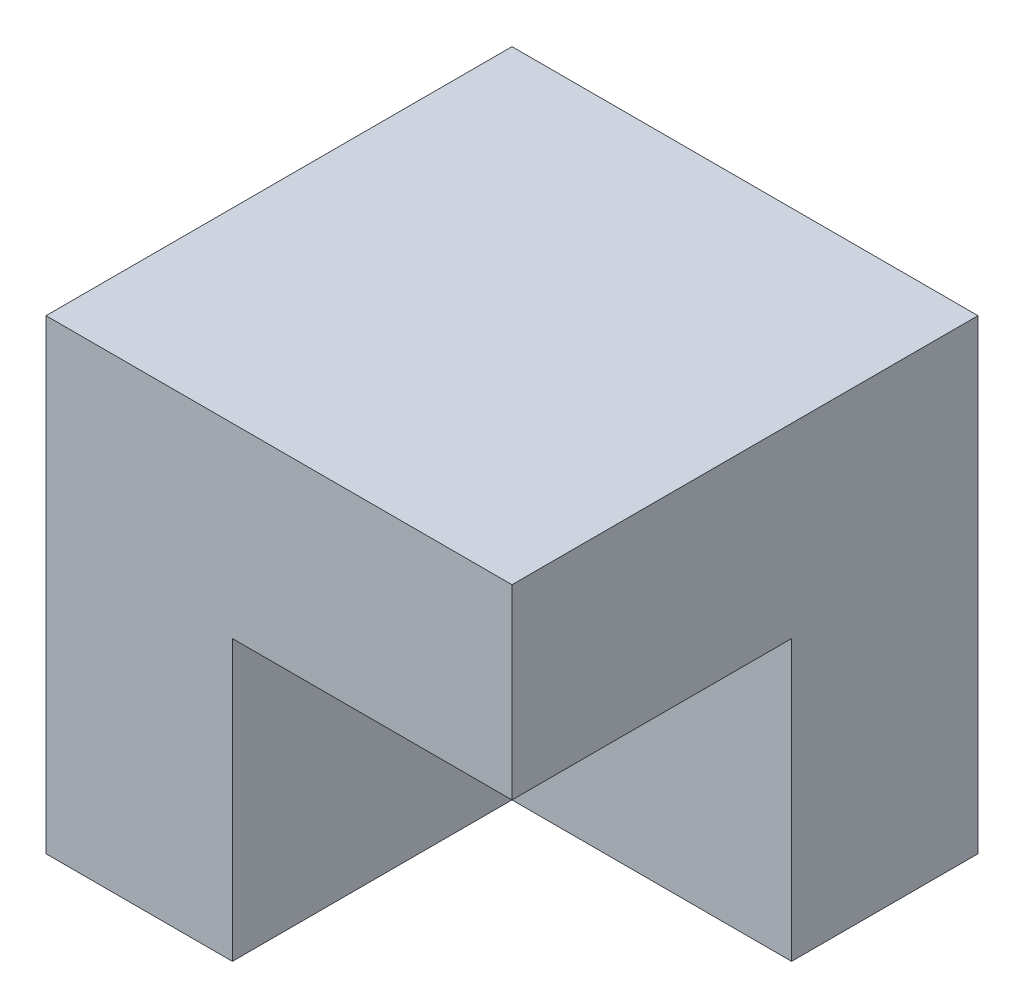
ISO-10303-21;
HEADER;
FILE_DESCRIPTION(('STEP AP214'),'2;1');
FILE_NAME('part.step','',(''),(''),'','','');
FILE_SCHEMA(('AUTOMOTIVE_DESIGN { 1 0 10303 214 1 1 1 1 }'));
ENDSEC;
DATA;
#1=APPLICATION_CONTEXT('core data for automotive mechanical design processes');
#2=APPLICATION_PROTOCOL_DEFINITION('international standard','automotive_design',2000,#1);
#3=PRODUCT_CONTEXT('',#1,'mechanical');
#4=PRODUCT('Part','Part','',(#3));
#5=PRODUCT_RELATED_PRODUCT_CATEGORY('part','',(#4));
#6=PRODUCT_DEFINITION_FORMATION('','',#4);
#7=PRODUCT_DEFINITION_CONTEXT('part definition',#1,'design');
#8=PRODUCT_DEFINITION('design','',#6,#7);
#9=PRODUCT_DEFINITION_SHAPE('','',#8);
#10=(LENGTH_UNIT() NAMED_UNIT(*) SI_UNIT(.MILLI.,.METRE.));
#11=(NAMED_UNIT(*) PLANE_ANGLE_UNIT() SI_UNIT($,.RADIAN.));
#12=(NAMED_UNIT(*) SI_UNIT($,.STERADIAN.) SOLID_ANGLE_UNIT());
#13=UNCERTAINTY_MEASURE_WITH_UNIT(LENGTH_MEASURE(1.E-05),#10,'distance_accuracy_value','');
#14=(GEOMETRIC_REPRESENTATION_CONTEXT(3) GLOBAL_UNCERTAINTY_ASSIGNED_CONTEXT((#13)) GLOBAL_UNIT_ASSIGNED_CONTEXT((#10,
#11,#12)) REPRESENTATION_CONTEXT('',''));
#15=CARTESIAN_POINT('',(0.,0.,0.));
#16=DIRECTION('',(0.,0.,1.));
#17=DIRECTION('',(1.,0.,0.));
#18=AXIS2_PLACEMENT_3D('',#15,#16,#17);
#19=CARTESIAN_POINT('',(-2.5,5.,2.5));
#20=DIRECTION('',(0.,0.,-1.));
#21=DIRECTION('',(-1.,0.,0.));
#22=AXIS2_PLACEMENT_3D('',#19,#20,#21);
#23=PLANE('',#22);
#24=DIRECTION('',(0.,-1.,0.));
#25=VECTOR('',#24,1.);
#26=CARTESIAN_POINT('',(-0.500000000000001,3.,2.5));
#27=LINE('',#26,#25);
#28=CARTESIAN_POINT('',(-0.500000000000001,3.,2.5));
#29=VERTEX_POINT('',#28);
#30=CARTESIAN_POINT('',(-0.500000000000001,0.,2.5));
#31=VERTEX_POINT('',#30);
#32=EDGE_CURVE('E61',#29,#31,#27,.T.);
#33=ORIENTED_EDGE('',*,*,#32,.F.);
#34=DIRECTION('',(1.,0.,0.));
#35=VECTOR('',#34,1.);
#36=CARTESIAN_POINT('',(2.5,3.,2.5));
#37=LINE('',#36,#35);
#38=CARTESIAN_POINT('',(2.5,3.,2.5));
#39=VERTEX_POINT('',#38);
#40=EDGE_CURVE('E148',#29,#39,#37,.T.);
#41=ORIENTED_EDGE('',*,*,#40,.T.);
#42=DIRECTION('',(0.,-1.,0.));
#43=VECTOR('',#42,1.);
#44=CARTESIAN_POINT('',(2.5,5.,2.5));
#45=LINE('',#44,#43);
#46=CARTESIAN_POINT('',(2.5,5.,2.5));
#47=VERTEX_POINT('',#46);
#48=EDGE_CURVE('E54',#47,#39,#45,.T.);
#49=ORIENTED_EDGE('',*,*,#48,.F.);
#50=DIRECTION('',(1.,0.,0.));
#51=VECTOR('',#50,1.);
#52=CARTESIAN_POINT('',(-2.5,5.,2.5));
#53=LINE('',#52,#51);
#54=CARTESIAN_POINT('',(-2.5,5.,2.5));
#55=VERTEX_POINT('',#54);
#56=EDGE_CURVE('E95',#55,#47,#53,.T.);
#57=ORIENTED_EDGE('',*,*,#56,.F.);
#58=DIRECTION('',(0.,-1.,0.));
#59=VECTOR('',#58,1.);
#60=CARTESIAN_POINT('',(-2.5,5.,2.5));
#61=LINE('',#60,#59);
#62=CARTESIAN_POINT('',(-2.5,0.,2.5));
#63=VERTEX_POINT('',#62);
#64=EDGE_CURVE('E11',#55,#63,#61,.T.);
#65=ORIENTED_EDGE('',*,*,#64,.T.);
#66=DIRECTION('',(1.,0.,0.));
#67=VECTOR('',#66,1.);
#68=CARTESIAN_POINT('',(-2.5,0.,2.5));
#69=LINE('',#68,#67);
#70=EDGE_CURVE('E171',#63,#31,#69,.T.);
#71=ORIENTED_EDGE('',*,*,#70,.T.);
#72=EDGE_LOOP('',(#33,#41,#49,#57,#65,#71));
#73=FACE_BOUND('',#72,.T.);
#74=ADVANCED_FACE('F45',(#73),#23,.F.);
#75=CARTESIAN_POINT('',(2.5,5.,-2.5));
#76=DIRECTION('',(-1.,0.,0.));
#77=DIRECTION('',(0.,0.,1.));
#78=AXIS2_PLACEMENT_3D('',#75,#76,#77);
#79=PLANE('',#78);
#80=DIRECTION('',(0.,-1.,0.));
#81=VECTOR('',#80,1.);
#82=CARTESIAN_POINT('',(2.5,3.,-0.5));
#83=LINE('',#82,#81);
#84=CARTESIAN_POINT('',(2.5,3.,-0.5));
#85=VERTEX_POINT('',#84);
#86=CARTESIAN_POINT('',(2.5,0.,-0.5));
#87=VERTEX_POINT('',#86);
#88=EDGE_CURVE('E127',#85,#87,#83,.T.);
#89=ORIENTED_EDGE('',*,*,#88,.T.);
#90=DIRECTION('',(0.,0.,-1.));
#91=VECTOR('',#90,1.);
#92=CARTESIAN_POINT('',(2.5,0.,-2.5));
#93=LINE('',#92,#91);
#94=CARTESIAN_POINT('',(2.5,0.,-2.5));
#95=VERTEX_POINT('',#94);
#96=EDGE_CURVE('E175',#87,#95,#93,.T.);
#97=ORIENTED_EDGE('',*,*,#96,.T.);
#98=DIRECTION('',(0.,-1.,0.));
#99=VECTOR('',#98,1.);
#100=CARTESIAN_POINT('',(2.5,5.,-2.5));
#101=LINE('',#100,#99);
#102=CARTESIAN_POINT('',(2.5,5.,-2.5));
#103=VERTEX_POINT('',#102);
#104=EDGE_CURVE('E182',#103,#95,#101,.T.);
#105=ORIENTED_EDGE('',*,*,#104,.F.);
#106=DIRECTION('',(0.,0.,-1.));
#107=VECTOR('',#106,1.);
#108=CARTESIAN_POINT('',(2.5,5.,-2.5));
#109=LINE('',#108,#107);
#110=EDGE_CURVE('E162',#47,#103,#109,.T.);
#111=ORIENTED_EDGE('',*,*,#110,.F.);
#112=ORIENTED_EDGE('',*,*,#48,.T.);
#113=DIRECTION('',(0.,0.,-1.));
#114=VECTOR('',#113,1.);
#115=CARTESIAN_POINT('',(2.5,3.,2.5));
#116=LINE('',#115,#114);
#117=EDGE_CURVE('E119',#39,#85,#116,.T.);
#118=ORIENTED_EDGE('',*,*,#117,.T.);
#119=EDGE_LOOP('',(#89,#97,#105,#111,#112,#118));
#120=FACE_BOUND('',#119,.T.);
#121=ADVANCED_FACE('F138',(#120),#79,.F.);
#122=CARTESIAN_POINT('',(0.,0.,0.));
#123=DIRECTION('',(0.,1.,0.));
#124=DIRECTION('',(0.,0.,1.));
#125=AXIS2_PLACEMENT_3D('',#122,#123,#124);
#126=PLANE('',#125);
#127=DIRECTION('',(-1.,0.,0.));
#128=VECTOR('',#127,1.);
#129=CARTESIAN_POINT('',(2.5,0.,-0.5));
#130=LINE('',#129,#128);
#131=CARTESIAN_POINT('',(-0.5,0.,-0.5));
#132=VERTEX_POINT('',#131);
#133=EDGE_CURVE('E130',#87,#132,#130,.T.);
#134=ORIENTED_EDGE('',*,*,#133,.T.);
#135=DIRECTION('',(0.,0.,1.));
#136=VECTOR('',#135,1.);
#137=CARTESIAN_POINT('',(-0.500000000000001,0.,2.5));
#138=LINE('',#137,#136);
#139=EDGE_CURVE('E141',#132,#31,#138,.T.);
#140=ORIENTED_EDGE('',*,*,#139,.T.);
#141=ORIENTED_EDGE('',*,*,#70,.F.);
#142=DIRECTION('',(0.,0.,1.));
#143=VECTOR('',#142,1.);
#144=CARTESIAN_POINT('',(-2.5,0.,-2.5));
#145=LINE('',#144,#143);
#146=CARTESIAN_POINT('',(-2.5,0.,-2.5));
#147=VERTEX_POINT('',#146);
#148=EDGE_CURVE('E134',#147,#63,#145,.T.);
#149=ORIENTED_EDGE('',*,*,#148,.F.);
#150=DIRECTION('',(-1.,0.,0.));
#151=VECTOR('',#150,1.);
#152=CARTESIAN_POINT('',(-2.5,0.,-2.5));
#153=LINE('',#152,#151);
#154=EDGE_CURVE('E88',#95,#147,#153,.T.);
#155=ORIENTED_EDGE('',*,*,#154,.F.);
#156=ORIENTED_EDGE('',*,*,#96,.F.);
#157=EDGE_LOOP('',(#134,#140,#141,#149,#155,#156));
#158=FACE_BOUND('',#157,.T.);
#159=ADVANCED_FACE('F189',(#158),#126,.F.);
#160=CARTESIAN_POINT('',(-2.5,5.,-2.5));
#161=DIRECTION('',(1.,0.,0.));
#162=DIRECTION('',(0.,0.,-1.));
#163=AXIS2_PLACEMENT_3D('',#160,#161,#162);
#164=PLANE('',#163);
#165=ORIENTED_EDGE('',*,*,#148,.T.);
#166=ORIENTED_EDGE('',*,*,#64,.F.);
#167=DIRECTION('',(0.,0.,1.));
#168=VECTOR('',#167,1.);
#169=CARTESIAN_POINT('',(-2.5,5.,-2.5));
#170=LINE('',#169,#168);
#171=CARTESIAN_POINT('',(-2.5,5.,-2.5));
#172=VERTEX_POINT('',#171);
#173=EDGE_CURVE('E157',#172,#55,#170,.T.);
#174=ORIENTED_EDGE('',*,*,#173,.F.);
#175=DIRECTION('',(0.,-1.,0.));
#176=VECTOR('',#175,1.);
#177=CARTESIAN_POINT('',(-2.5,5.,-2.5));
#178=LINE('',#177,#176);
#179=EDGE_CURVE('E167',#172,#147,#178,.T.);
#180=ORIENTED_EDGE('',*,*,#179,.T.);
#181=EDGE_LOOP('',(#165,#166,#174,#180));
#182=FACE_BOUND('',#181,.T.);
#183=ADVANCED_FACE('F47',(#182),#164,.F.);
#184=CARTESIAN_POINT('',(-2.5,5.,-2.5));
#185=DIRECTION('',(0.,0.,1.));
#186=DIRECTION('',(1.,0.,0.));
#187=AXIS2_PLACEMENT_3D('',#184,#185,#186);
#188=PLANE('',#187);
#189=ORIENTED_EDGE('',*,*,#154,.T.);
#190=ORIENTED_EDGE('',*,*,#179,.F.);
#191=DIRECTION('',(-1.,0.,0.));
#192=VECTOR('',#191,1.);
#193=CARTESIAN_POINT('',(-2.5,5.,-2.5));
#194=LINE('',#193,#192);
#195=EDGE_CURVE('E70',#103,#172,#194,.T.);
#196=ORIENTED_EDGE('',*,*,#195,.F.);
#197=ORIENTED_EDGE('',*,*,#104,.T.);
#198=EDGE_LOOP('',(#189,#190,#196,#197));
#199=FACE_BOUND('',#198,.T.);
#200=ADVANCED_FACE('F186',(#199),#188,.F.);
#201=CARTESIAN_POINT('',(0.,5.,0.));
#202=DIRECTION('',(0.,1.,0.));
#203=DIRECTION('',(0.,0.,1.));
#204=AXIS2_PLACEMENT_3D('',#201,#202,#203);
#205=PLANE('',#204);
#206=ORIENTED_EDGE('',*,*,#173,.T.);
#207=ORIENTED_EDGE('',*,*,#56,.T.);
#208=ORIENTED_EDGE('',*,*,#110,.T.);
#209=ORIENTED_EDGE('',*,*,#195,.T.);
#210=EDGE_LOOP('',(#206,#207,#208,#209));
#211=FACE_BOUND('',#210,.T.);
#212=ADVANCED_FACE('F193',(#211),#205,.T.);
#213=CARTESIAN_POINT('',(2.5,3.,-0.5));
#214=DIRECTION('',(0.,0.,1.));
#215=DIRECTION('',(1.,0.,0.));
#216=AXIS2_PLACEMENT_3D('',#213,#214,#215);
#217=PLANE('',#216);
#218=ORIENTED_EDGE('',*,*,#133,.F.);
#219=ORIENTED_EDGE('',*,*,#88,.F.);
#220=DIRECTION('',(-1.,0.,0.));
#221=VECTOR('',#220,1.);
#222=CARTESIAN_POINT('',(2.5,3.,-0.5));
#223=LINE('',#222,#221);
#224=CARTESIAN_POINT('',(-0.5,3.,-0.5));
#225=VERTEX_POINT('',#224);
#226=EDGE_CURVE('E114',#85,#225,#223,.T.);
#227=ORIENTED_EDGE('',*,*,#226,.T.);
#228=DIRECTION('',(0.,-1.,0.));
#229=VECTOR('',#228,1.);
#230=CARTESIAN_POINT('',(-0.5,3.,-0.5));
#231=LINE('',#230,#229);
#232=EDGE_CURVE('E135',#225,#132,#231,.T.);
#233=ORIENTED_EDGE('',*,*,#232,.T.);
#234=EDGE_LOOP('',(#218,#219,#227,#233));
#235=FACE_BOUND('',#234,.T.);
#236=ADVANCED_FACE('F128',(#235),#217,.T.);
#237=CARTESIAN_POINT('',(-0.500000000000001,3.,2.5));
#238=DIRECTION('',(1.,0.,0.));
#239=DIRECTION('',(0.,0.,-1.));
#240=AXIS2_PLACEMENT_3D('',#237,#238,#239);
#241=PLANE('',#240);
#242=ORIENTED_EDGE('',*,*,#139,.F.);
#243=ORIENTED_EDGE('',*,*,#232,.F.);
#244=DIRECTION('',(0.,0.,1.));
#245=VECTOR('',#244,1.);
#246=CARTESIAN_POINT('',(-0.500000000000001,3.,2.5));
#247=LINE('',#246,#245);
#248=EDGE_CURVE('E121',#225,#29,#247,.T.);
#249=ORIENTED_EDGE('',*,*,#248,.T.);
#250=ORIENTED_EDGE('',*,*,#32,.T.);
#251=EDGE_LOOP('',(#242,#243,#249,#250));
#252=FACE_BOUND('',#251,.T.);
#253=ADVANCED_FACE('F208',(#252),#241,.T.);
#254=CARTESIAN_POINT('',(0.,3.,0.));
#255=DIRECTION('',(0.,1.,0.));
#256=DIRECTION('',(0.,0.,1.));
#257=AXIS2_PLACEMENT_3D('',#254,#255,#256);
#258=PLANE('',#257);
#259=ORIENTED_EDGE('',*,*,#117,.F.);
#260=ORIENTED_EDGE('',*,*,#40,.F.);
#261=ORIENTED_EDGE('',*,*,#248,.F.);
#262=ORIENTED_EDGE('',*,*,#226,.F.);
#263=EDGE_LOOP('',(#259,#260,#261,#262));
#264=FACE_BOUND('',#263,.T.);
#265=ADVANCED_FACE('F116',(#264),#258,.F.);
#266=CLOSED_SHELL('',(#74,#121,#159,#183,#200,#212,#236,#253,#265));
#267=MANIFOLD_SOLID_BREP('B2',#266);
#268=ADVANCED_BREP_SHAPE_REPRESENTATION('',(#18,#267),#14);
#269=SHAPE_DEFINITION_REPRESENTATION(#9,#268);
ENDSEC;
END-ISO-10303-21;
